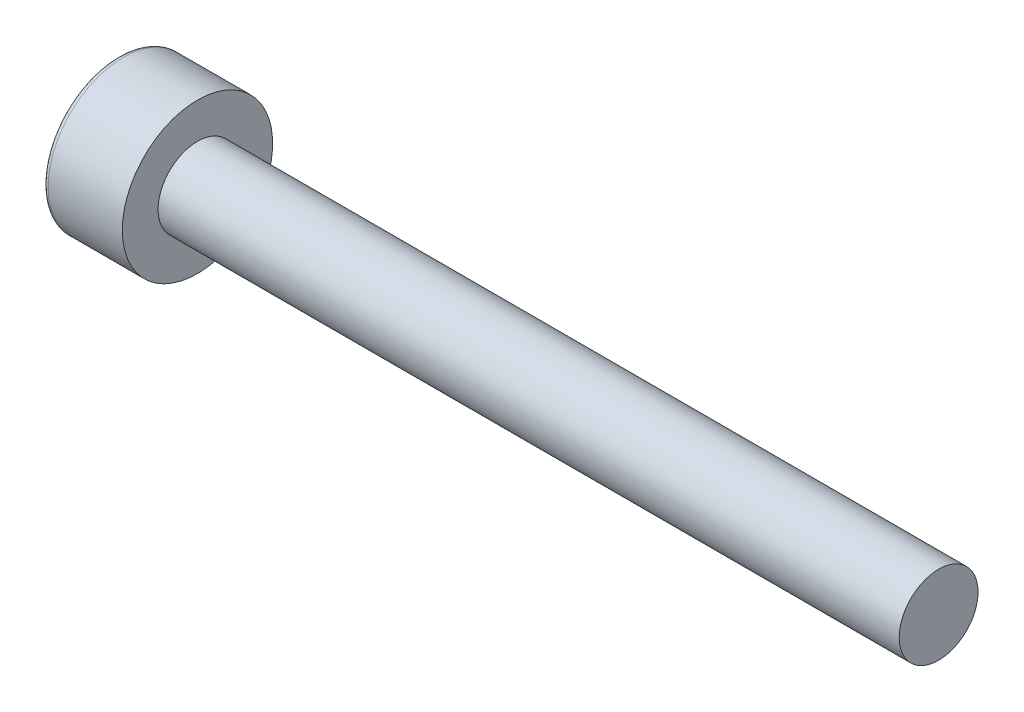
ISO-10303-21;
HEADER;
FILE_DESCRIPTION(('STEP AP214'),'2;1');
FILE_NAME('part.step','',(''),(''),'','','');
FILE_SCHEMA(('AUTOMOTIVE_DESIGN { 1 0 10303 214 1 1 1 1 }'));
ENDSEC;
DATA;
#1=APPLICATION_CONTEXT('core data for automotive mechanical design processes');
#2=APPLICATION_PROTOCOL_DEFINITION('international standard','automotive_design',2000,#1);
#3=PRODUCT_CONTEXT('',#1,'mechanical');
#4=PRODUCT('Part','Part','',(#3));
#5=PRODUCT_RELATED_PRODUCT_CATEGORY('part','',(#4));
#6=PRODUCT_DEFINITION_FORMATION('','',#4);
#7=PRODUCT_DEFINITION_CONTEXT('part definition',#1,'design');
#8=PRODUCT_DEFINITION('design','',#6,#7);
#9=PRODUCT_DEFINITION_SHAPE('','',#8);
#10=(LENGTH_UNIT() NAMED_UNIT(*) SI_UNIT(.MILLI.,.METRE.));
#11=(NAMED_UNIT(*) PLANE_ANGLE_UNIT() SI_UNIT($,.RADIAN.));
#12=(NAMED_UNIT(*) SI_UNIT($,.STERADIAN.) SOLID_ANGLE_UNIT());
#13=UNCERTAINTY_MEASURE_WITH_UNIT(LENGTH_MEASURE(1.E-05),#10,'distance_accuracy_value','');
#14=(GEOMETRIC_REPRESENTATION_CONTEXT(3) GLOBAL_UNCERTAINTY_ASSIGNED_CONTEXT((#13)) GLOBAL_UNIT_ASSIGNED_CONTEXT((#10,
#11,#12)) REPRESENTATION_CONTEXT('',''));
#15=CARTESIAN_POINT('',(0.,0.,0.));
#16=DIRECTION('',(0.,0.,1.));
#17=DIRECTION('',(1.,0.,0.));
#18=AXIS2_PLACEMENT_3D('',#15,#16,#17);
#19=CARTESIAN_POINT('',(0.,0.,0.));
#20=DIRECTION('',(1.,0.,0.));
#21=DIRECTION('',(0.,0.,-1.));
#22=AXIS2_PLACEMENT_3D('',#19,#20,#21);
#23=PLANE('',#22);
#24=CARTESIAN_POINT('',(0.,0.,0.));
#25=DIRECTION('',(1.,0.,0.));
#26=DIRECTION('',(0.,0.,-1.));
#27=AXIS2_PLACEMENT_3D('',#24,#25,#26);
#28=CIRCLE('',#27,2.64);
#29=CARTESIAN_POINT('',(0.,0.,-2.64));
#30=VERTEX_POINT('',#29);
#31=EDGE_CURVE('E47',#30,#30,#28,.F.);
#32=ORIENTED_EDGE('',*,*,#31,.T.);
#33=EDGE_LOOP('',(#32));
#34=FACE_BOUND('',#33,.T.);
#35=DIRECTION('',(0.,-0.866025403784439,0.5));
#36=VECTOR('',#35,1.);
#37=CARTESIAN_POINT('',(0.,0.,-1.44337567297406));
#38=LINE('',#37,#36);
#39=CARTESIAN_POINT('',(0.,0.,-1.44337567297406));
#40=VERTEX_POINT('',#39);
#41=CARTESIAN_POINT('',(0.,-1.25,-0.721687836487033));
#42=VERTEX_POINT('',#41);
#43=EDGE_CURVE('E128',#40,#42,#38,.T.);
#44=ORIENTED_EDGE('',*,*,#43,.F.);
#45=DIRECTION('',(0.,-0.866025403784439,-0.5));
#46=VECTOR('',#45,1.);
#47=CARTESIAN_POINT('',(0.,1.25,-0.721687836487032));
#48=LINE('',#47,#46);
#49=CARTESIAN_POINT('',(0.,1.25,-0.721687836487032));
#50=VERTEX_POINT('',#49);
#51=EDGE_CURVE('E54',#50,#40,#48,.T.);
#52=ORIENTED_EDGE('',*,*,#51,.F.);
#53=DIRECTION('',(0.,0.,-1.));
#54=VECTOR('',#53,1.);
#55=CARTESIAN_POINT('',(0.,1.25,0.721687836487033));
#56=LINE('',#55,#54);
#57=CARTESIAN_POINT('',(0.,1.25,0.721687836487033));
#58=VERTEX_POINT('',#57);
#59=EDGE_CURVE('E137',#58,#50,#56,.T.);
#60=ORIENTED_EDGE('',*,*,#59,.F.);
#61=DIRECTION('',(0.,0.866025403784439,-0.5));
#62=VECTOR('',#61,1.);
#63=CARTESIAN_POINT('',(0.,0.,1.44337567297406));
#64=LINE('',#63,#62);
#65=CARTESIAN_POINT('',(0.,0.,1.44337567297406));
#66=VERTEX_POINT('',#65);
#67=EDGE_CURVE('E135',#66,#58,#64,.T.);
#68=ORIENTED_EDGE('',*,*,#67,.F.);
#69=DIRECTION('',(0.,0.866025403784439,0.5));
#70=VECTOR('',#69,1.);
#71=CARTESIAN_POINT('',(0.,-1.25,0.721687836487032));
#72=LINE('',#71,#70);
#73=CARTESIAN_POINT('',(0.,-1.25,0.721687836487032));
#74=VERTEX_POINT('',#73);
#75=EDGE_CURVE('E102',#74,#66,#72,.T.);
#76=ORIENTED_EDGE('',*,*,#75,.F.);
#77=DIRECTION('',(0.,0.,1.));
#78=VECTOR('',#77,1.);
#79=CARTESIAN_POINT('',(0.,-1.25,-0.721687836487033));
#80=LINE('',#79,#78);
#81=EDGE_CURVE('E131',#42,#74,#80,.T.);
#82=ORIENTED_EDGE('',*,*,#81,.F.);
#83=EDGE_LOOP('',(#44,#52,#60,#68,#76,#82));
#84=FACE_BOUND('',#83,.T.);
#85=ADVANCED_FACE('F39',(#34,#84),#23,.F.);
#86=CARTESIAN_POINT('',(0.,0.,0.));
#87=DIRECTION('',(-1.,0.,0.));
#88=DIRECTION('',(0.,0.,1.));
#89=AXIS2_PLACEMENT_3D('',#86,#87,#88);
#90=CYLINDRICAL_SURFACE('',#89,2.84);
#91=CARTESIAN_POINT('',(0.2,0.,0.));
#92=DIRECTION('',(1.,0.,0.));
#93=DIRECTION('',(0.,0.,-1.));
#94=AXIS2_PLACEMENT_3D('',#91,#92,#93);
#95=CIRCLE('',#94,2.84);
#96=CARTESIAN_POINT('',(0.2,0.,-2.84));
#97=VERTEX_POINT('',#96);
#98=EDGE_CURVE('E11',#97,#97,#95,.T.);
#99=ORIENTED_EDGE('',*,*,#98,.T.);
#100=EDGE_LOOP('',(#99));
#101=FACE_BOUND('',#100,.T.);
#102=CARTESIAN_POINT('',(3.,0.,0.));
#103=DIRECTION('',(-1.,0.,0.));
#104=DIRECTION('',(0.,0.,1.));
#105=AXIS2_PLACEMENT_3D('',#102,#103,#104);
#106=CIRCLE('',#105,2.84);
#107=CARTESIAN_POINT('',(3.,0.,2.84));
#108=VERTEX_POINT('',#107);
#109=EDGE_CURVE('E152',#108,#108,#106,.T.);
#110=ORIENTED_EDGE('',*,*,#109,.T.);
#111=EDGE_LOOP('',(#110));
#112=FACE_BOUND('',#111,.T.);
#113=ADVANCED_FACE('F168',(#101,#112),#90,.T.);
#114=CARTESIAN_POINT('',(3.,2.84,0.));
#115=DIRECTION('',(-1.,0.,0.));
#116=DIRECTION('',(0.,0.,1.));
#117=AXIS2_PLACEMENT_3D('',#114,#115,#116);
#118=PLANE('',#117);
#119=ORIENTED_EDGE('',*,*,#109,.F.);
#120=EDGE_LOOP('',(#119));
#121=FACE_BOUND('',#120,.T.);
#122=CARTESIAN_POINT('',(3.,0.,0.));
#123=DIRECTION('',(-1.,0.,0.));
#124=DIRECTION('',(0.,0.,1.));
#125=AXIS2_PLACEMENT_3D('',#122,#123,#124);
#126=CIRCLE('',#125,1.49);
#127=CARTESIAN_POINT('',(3.,0.,1.49));
#128=VERTEX_POINT('',#127);
#129=EDGE_CURVE('E149',#128,#128,#126,.T.);
#130=ORIENTED_EDGE('',*,*,#129,.T.);
#131=EDGE_LOOP('',(#130));
#132=FACE_BOUND('',#131,.T.);
#133=ADVANCED_FACE('F172',(#121,#132),#118,.F.);
#134=CARTESIAN_POINT('',(0.,0.,0.));
#135=DIRECTION('',(-1.,0.,0.));
#136=DIRECTION('',(0.,0.,1.));
#137=AXIS2_PLACEMENT_3D('',#134,#135,#136);
#138=CYLINDRICAL_SURFACE('',#137,1.49);
#139=ORIENTED_EDGE('',*,*,#129,.F.);
#140=EDGE_LOOP('',(#139));
#141=FACE_BOUND('',#140,.T.);
#142=CARTESIAN_POINT('',(31.,0.,0.));
#143=DIRECTION('',(-1.,0.,0.));
#144=DIRECTION('',(0.,0.,1.));
#145=AXIS2_PLACEMENT_3D('',#142,#143,#144);
#146=CIRCLE('',#145,1.49);
#147=CARTESIAN_POINT('',(31.,0.,1.49));
#148=VERTEX_POINT('',#147);
#149=EDGE_CURVE('E141',#148,#148,#146,.T.);
#150=ORIENTED_EDGE('',*,*,#149,.T.);
#151=EDGE_LOOP('',(#150));
#152=FACE_BOUND('',#151,.T.);
#153=ADVANCED_FACE('F178',(#141,#152),#138,.T.);
#154=CARTESIAN_POINT('',(31.,1.49,0.));
#155=DIRECTION('',(-1.,0.,0.));
#156=DIRECTION('',(0.,0.,1.));
#157=AXIS2_PLACEMENT_3D('',#154,#155,#156);
#158=PLANE('',#157);
#159=ORIENTED_EDGE('',*,*,#149,.F.);
#160=EDGE_LOOP('',(#159));
#161=FACE_BOUND('',#160,.T.);
#162=ADVANCED_FACE('F182',(#161),#158,.F.);
#163=CARTESIAN_POINT('',(1.3,1.25,-0.721687836487032));
#164=DIRECTION('',(0.,0.5,-0.866025403784439));
#165=DIRECTION('',(0.,0.866025403784439,0.5));
#166=AXIS2_PLACEMENT_3D('',#163,#164,#165);
#167=PLANE('',#166);
#168=ORIENTED_EDGE('',*,*,#51,.T.);
#169=DIRECTION('',(-1.,0.,0.));
#170=VECTOR('',#169,1.);
#171=CARTESIAN_POINT('',(1.3,0.,-1.44337567297406));
#172=LINE('',#171,#170);
#173=CARTESIAN_POINT('',(1.3,0.,-1.44337567297406));
#174=VERTEX_POINT('',#173);
#175=EDGE_CURVE('E84',#174,#40,#172,.T.);
#176=ORIENTED_EDGE('',*,*,#175,.F.);
#177=DIRECTION('',(0.,-0.866025403784439,-0.5));
#178=VECTOR('',#177,1.);
#179=CARTESIAN_POINT('',(1.3,1.25,-0.721687836487032));
#180=LINE('',#179,#178);
#181=CARTESIAN_POINT('',(1.3,1.25,-0.721687836487032));
#182=VERTEX_POINT('',#181);
#183=EDGE_CURVE('E139',#182,#174,#180,.T.);
#184=ORIENTED_EDGE('',*,*,#183,.F.);
#185=DIRECTION('',(-1.,0.,0.));
#186=VECTOR('',#185,1.);
#187=CARTESIAN_POINT('',(1.3,1.25,-0.721687836487032));
#188=LINE('',#187,#186);
#189=EDGE_CURVE('E62',#182,#50,#188,.T.);
#190=ORIENTED_EDGE('',*,*,#189,.T.);
#191=EDGE_LOOP('',(#168,#176,#184,#190));
#192=FACE_BOUND('',#191,.T.);
#193=ADVANCED_FACE('F186',(#192),#167,.F.);
#194=CARTESIAN_POINT('',(1.3,1.25,0.721687836487033));
#195=DIRECTION('',(0.,1.,0.));
#196=DIRECTION('',(0.,0.,1.));
#197=AXIS2_PLACEMENT_3D('',#194,#195,#196);
#198=PLANE('',#197);
#199=ORIENTED_EDGE('',*,*,#59,.T.);
#200=ORIENTED_EDGE('',*,*,#189,.F.);
#201=DIRECTION('',(0.,0.,-1.));
#202=VECTOR('',#201,1.);
#203=CARTESIAN_POINT('',(1.3,1.25,0.721687836487033));
#204=LINE('',#203,#202);
#205=CARTESIAN_POINT('',(1.3,1.25,0.721687836487033));
#206=VERTEX_POINT('',#205);
#207=EDGE_CURVE('E114',#206,#182,#204,.T.);
#208=ORIENTED_EDGE('',*,*,#207,.F.);
#209=DIRECTION('',(-1.,0.,0.));
#210=VECTOR('',#209,1.);
#211=CARTESIAN_POINT('',(1.3,1.25,0.721687836487033));
#212=LINE('',#211,#210);
#213=EDGE_CURVE('E106',#206,#58,#212,.T.);
#214=ORIENTED_EDGE('',*,*,#213,.T.);
#215=EDGE_LOOP('',(#199,#200,#208,#214));
#216=FACE_BOUND('',#215,.T.);
#217=ADVANCED_FACE('F190',(#216),#198,.F.);
#218=CARTESIAN_POINT('',(1.3,0.,1.44337567297406));
#219=DIRECTION('',(0.,0.5,0.866025403784439));
#220=DIRECTION('',(0.,-0.866025403784439,0.5));
#221=AXIS2_PLACEMENT_3D('',#218,#219,#220);
#222=PLANE('',#221);
#223=ORIENTED_EDGE('',*,*,#67,.T.);
#224=ORIENTED_EDGE('',*,*,#213,.F.);
#225=DIRECTION('',(0.,0.866025403784439,-0.5));
#226=VECTOR('',#225,1.);
#227=CARTESIAN_POINT('',(1.3,0.,1.44337567297406));
#228=LINE('',#227,#226);
#229=CARTESIAN_POINT('',(1.3,0.,1.44337567297406));
#230=VERTEX_POINT('',#229);
#231=EDGE_CURVE('E110',#230,#206,#228,.T.);
#232=ORIENTED_EDGE('',*,*,#231,.F.);
#233=DIRECTION('',(-1.,0.,0.));
#234=VECTOR('',#233,1.);
#235=CARTESIAN_POINT('',(1.3,0.,1.44337567297406));
#236=LINE('',#235,#234);
#237=EDGE_CURVE('E95',#230,#66,#236,.T.);
#238=ORIENTED_EDGE('',*,*,#237,.T.);
#239=EDGE_LOOP('',(#223,#224,#232,#238));
#240=FACE_BOUND('',#239,.T.);
#241=ADVANCED_FACE('F111',(#240),#222,.F.);
#242=CARTESIAN_POINT('',(1.3,-1.25,0.721687836487032));
#243=DIRECTION('',(0.,-0.5,0.866025403784439));
#244=DIRECTION('',(0.,-0.866025403784439,-0.5));
#245=AXIS2_PLACEMENT_3D('',#242,#243,#244);
#246=PLANE('',#245);
#247=ORIENTED_EDGE('',*,*,#75,.T.);
#248=ORIENTED_EDGE('',*,*,#237,.F.);
#249=DIRECTION('',(0.,0.866025403784439,0.5));
#250=VECTOR('',#249,1.);
#251=CARTESIAN_POINT('',(1.3,-1.25,0.721687836487032));
#252=LINE('',#251,#250);
#253=CARTESIAN_POINT('',(1.3,-1.25,0.721687836487032));
#254=VERTEX_POINT('',#253);
#255=EDGE_CURVE('E99',#254,#230,#252,.T.);
#256=ORIENTED_EDGE('',*,*,#255,.F.);
#257=DIRECTION('',(-1.,0.,0.));
#258=VECTOR('',#257,1.);
#259=CARTESIAN_POINT('',(1.3,-1.25,0.721687836487032));
#260=LINE('',#259,#258);
#261=EDGE_CURVE('E107',#254,#74,#260,.T.);
#262=ORIENTED_EDGE('',*,*,#261,.T.);
#263=EDGE_LOOP('',(#247,#248,#256,#262));
#264=FACE_BOUND('',#263,.T.);
#265=ADVANCED_FACE('F97',(#264),#246,.F.);
#266=CARTESIAN_POINT('',(1.3,-1.25,-0.721687836487033));
#267=DIRECTION('',(0.,-1.,0.));
#268=DIRECTION('',(0.,0.,-1.));
#269=AXIS2_PLACEMENT_3D('',#266,#267,#268);
#270=PLANE('',#269);
#271=ORIENTED_EDGE('',*,*,#81,.T.);
#272=ORIENTED_EDGE('',*,*,#261,.F.);
#273=DIRECTION('',(0.,0.,1.));
#274=VECTOR('',#273,1.);
#275=CARTESIAN_POINT('',(1.3,-1.25,-0.721687836487033));
#276=LINE('',#275,#274);
#277=CARTESIAN_POINT('',(1.3,-1.25,-0.721687836487033));
#278=VERTEX_POINT('',#277);
#279=EDGE_CURVE('E120',#278,#254,#276,.T.);
#280=ORIENTED_EDGE('',*,*,#279,.F.);
#281=DIRECTION('',(-1.,0.,0.));
#282=VECTOR('',#281,1.);
#283=CARTESIAN_POINT('',(1.3,-1.25,-0.721687836487033));
#284=LINE('',#283,#282);
#285=EDGE_CURVE('E144',#278,#42,#284,.T.);
#286=ORIENTED_EDGE('',*,*,#285,.T.);
#287=EDGE_LOOP('',(#271,#272,#280,#286));
#288=FACE_BOUND('',#287,.T.);
#289=ADVANCED_FACE('F193',(#288),#270,.F.);
#290=CARTESIAN_POINT('',(1.3,0.,-1.44337567297406));
#291=DIRECTION('',(0.,-0.5,-0.866025403784439));
#292=DIRECTION('',(0.,0.866025403784439,-0.5));
#293=AXIS2_PLACEMENT_3D('',#290,#291,#292);
#294=PLANE('',#293);
#295=ORIENTED_EDGE('',*,*,#43,.T.);
#296=ORIENTED_EDGE('',*,*,#285,.F.);
#297=DIRECTION('',(0.,-0.866025403784439,0.5));
#298=VECTOR('',#297,1.);
#299=CARTESIAN_POINT('',(1.3,0.,-1.44337567297406));
#300=LINE('',#299,#298);
#301=EDGE_CURVE('E122',#174,#278,#300,.T.);
#302=ORIENTED_EDGE('',*,*,#301,.F.);
#303=ORIENTED_EDGE('',*,*,#175,.T.);
#304=EDGE_LOOP('',(#295,#296,#302,#303));
#305=FACE_BOUND('',#304,.T.);
#306=ADVANCED_FACE('F164',(#305),#294,.F.);
#307=CARTESIAN_POINT('',(1.3,0.,0.));
#308=DIRECTION('',(-1.,0.,0.));
#309=DIRECTION('',(0.,0.,1.));
#310=AXIS2_PLACEMENT_3D('',#307,#308,#309);
#311=PLANE('',#310);
#312=ORIENTED_EDGE('',*,*,#183,.T.);
#313=ORIENTED_EDGE('',*,*,#301,.T.);
#314=ORIENTED_EDGE('',*,*,#279,.T.);
#315=ORIENTED_EDGE('',*,*,#255,.T.);
#316=ORIENTED_EDGE('',*,*,#231,.T.);
#317=ORIENTED_EDGE('',*,*,#207,.T.);
#318=EDGE_LOOP('',(#312,#313,#314,#315,#316,#317));
#319=FACE_BOUND('',#318,.T.);
#320=ADVANCED_FACE('F117',(#319),#311,.T.);
#321=CARTESIAN_POINT('',(0.2,0.,0.));
#322=DIRECTION('',(1.,0.,0.));
#323=DIRECTION('',(0.,0.,-1.));
#324=AXIS2_PLACEMENT_3D('',#321,#322,#323);
#325=TOROIDAL_SURFACE('',#324,2.64,0.2);
#326=ORIENTED_EDGE('',*,*,#98,.F.);
#327=EDGE_LOOP('',(#326));
#328=FACE_BOUND('',#327,.T.);
#329=ORIENTED_EDGE('',*,*,#31,.F.);
#330=EDGE_LOOP('',(#329));
#331=FACE_BOUND('',#330,.T.);
#332=ADVANCED_FACE('F41',(#328,#331),#325,.T.);
#333=CLOSED_SHELL('',(#85,#113,#133,#153,#162,#193,#217,#241,#265,#289,#306,#320,#332));
#334=MANIFOLD_SOLID_BREP('B2',#333);
#335=ADVANCED_BREP_SHAPE_REPRESENTATION('',(#18,#334),#14);
#336=SHAPE_DEFINITION_REPRESENTATION(#9,#335);
ENDSEC;
END-ISO-10303-21;
